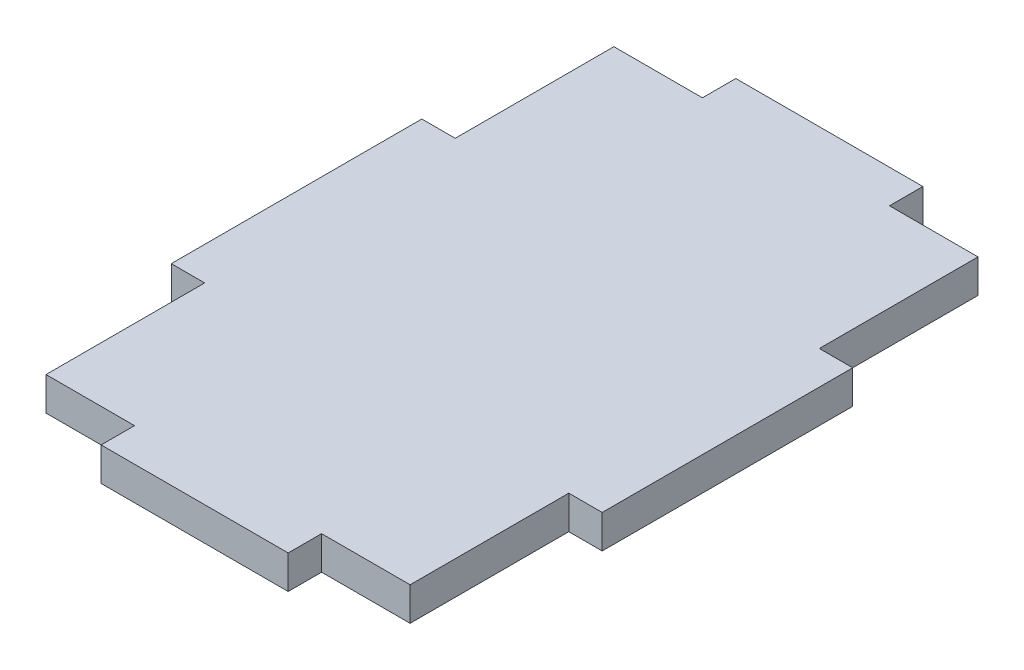
ISO-10303-21;
HEADER;
FILE_DESCRIPTION(('STEP AP214'),'2;1');
FILE_NAME('part.step','',(''),(''),'','','');
FILE_SCHEMA(('AUTOMOTIVE_DESIGN { 1 0 10303 214 1 1 1 1 }'));
ENDSEC;
DATA;
#1=APPLICATION_CONTEXT('core data for automotive mechanical design processes');
#2=APPLICATION_PROTOCOL_DEFINITION('international standard','automotive_design',2000,#1);
#3=PRODUCT_CONTEXT('',#1,'mechanical');
#4=PRODUCT('Part','Part','',(#3));
#5=PRODUCT_RELATED_PRODUCT_CATEGORY('part','',(#4));
#6=PRODUCT_DEFINITION_FORMATION('','',#4);
#7=PRODUCT_DEFINITION_CONTEXT('part definition',#1,'design');
#8=PRODUCT_DEFINITION('design','',#6,#7);
#9=PRODUCT_DEFINITION_SHAPE('','',#8);
#10=(LENGTH_UNIT() NAMED_UNIT(*) SI_UNIT(.MILLI.,.METRE.));
#11=(NAMED_UNIT(*) PLANE_ANGLE_UNIT() SI_UNIT($,.RADIAN.));
#12=(NAMED_UNIT(*) SI_UNIT($,.STERADIAN.) SOLID_ANGLE_UNIT());
#13=UNCERTAINTY_MEASURE_WITH_UNIT(LENGTH_MEASURE(1.E-05),#10,'distance_accuracy_value','');
#14=(GEOMETRIC_REPRESENTATION_CONTEXT(3) GLOBAL_UNCERTAINTY_ASSIGNED_CONTEXT((#13)) GLOBAL_UNIT_ASSIGNED_CONTEXT((#10,
#11,#12)) REPRESENTATION_CONTEXT('',''));
#15=CARTESIAN_POINT('',(0.,0.,0.));
#16=DIRECTION('',(0.,0.,1.));
#17=DIRECTION('',(1.,0.,0.));
#18=AXIS2_PLACEMENT_3D('',#15,#16,#17);
#19=CARTESIAN_POINT('',(32.25,5.,-18.75));
#20=DIRECTION('',(-1.,0.,0.));
#21=DIRECTION('',(0.,0.,1.));
#22=AXIS2_PLACEMENT_3D('',#19,#20,#21);
#23=PLANE('',#22);
#24=DIRECTION('',(0.,0.,-1.));
#25=VECTOR('',#24,1.);
#26=CARTESIAN_POINT('',(32.25,0.,-18.75));
#27=LINE('',#26,#25);
#28=CARTESIAN_POINT('',(32.25,0.,18.75));
#29=VERTEX_POINT('',#28);
#30=CARTESIAN_POINT('',(32.25,0.,-18.75));
#31=VERTEX_POINT('',#30);
#32=EDGE_CURVE('E201',#29,#31,#27,.T.);
#33=ORIENTED_EDGE('',*,*,#32,.T.);
#34=DIRECTION('',(0.,-1.,0.));
#35=VECTOR('',#34,1.);
#36=CARTESIAN_POINT('',(32.25,5.,-18.75));
#37=LINE('',#36,#35);
#38=CARTESIAN_POINT('',(32.25,5.,-18.75));
#39=VERTEX_POINT('',#38);
#40=EDGE_CURVE('E11',#39,#31,#37,.T.);
#41=ORIENTED_EDGE('',*,*,#40,.F.);
#42=DIRECTION('',(0.,0.,-1.));
#43=VECTOR('',#42,1.);
#44=CARTESIAN_POINT('',(32.25,5.,-18.75));
#45=LINE('',#44,#43);
#46=CARTESIAN_POINT('',(32.25,5.,18.75));
#47=VERTEX_POINT('',#46);
#48=EDGE_CURVE('E239',#47,#39,#45,.T.);
#49=ORIENTED_EDGE('',*,*,#48,.F.);
#50=DIRECTION('',(0.,-1.,0.));
#51=VECTOR('',#50,1.);
#52=CARTESIAN_POINT('',(32.25,5.,18.75));
#53=LINE('',#52,#51);
#54=EDGE_CURVE('E197',#47,#29,#53,.T.);
#55=ORIENTED_EDGE('',*,*,#54,.T.);
#56=EDGE_LOOP('',(#33,#41,#49,#55));
#57=FACE_BOUND('',#56,.T.);
#58=ADVANCED_FACE('F33',(#57),#23,.F.);
#59=CARTESIAN_POINT('',(27.25,5.,-18.75));
#60=DIRECTION('',(0.,0.,1.));
#61=DIRECTION('',(1.,0.,0.));
#62=AXIS2_PLACEMENT_3D('',#59,#60,#61);
#63=PLANE('',#62);
#64=DIRECTION('',(-1.,0.,0.));
#65=VECTOR('',#64,1.);
#66=CARTESIAN_POINT('',(27.25,0.,-18.75));
#67=LINE('',#66,#65);
#68=CARTESIAN_POINT('',(27.25,0.,-18.75));
#69=VERTEX_POINT('',#68);
#70=EDGE_CURVE('E204',#31,#69,#67,.T.);
#71=ORIENTED_EDGE('',*,*,#70,.T.);
#72=DIRECTION('',(0.,-1.,0.));
#73=VECTOR('',#72,1.);
#74=CARTESIAN_POINT('',(27.25,5.,-18.75));
#75=LINE('',#74,#73);
#76=CARTESIAN_POINT('',(27.25,5.,-18.75));
#77=VERTEX_POINT('',#76);
#78=EDGE_CURVE('E41',#77,#69,#75,.T.);
#79=ORIENTED_EDGE('',*,*,#78,.F.);
#80=DIRECTION('',(-1.,0.,0.));
#81=VECTOR('',#80,1.);
#82=CARTESIAN_POINT('',(27.25,5.,-18.75));
#83=LINE('',#82,#81);
#84=EDGE_CURVE('E128',#39,#77,#83,.T.);
#85=ORIENTED_EDGE('',*,*,#84,.F.);
#86=ORIENTED_EDGE('',*,*,#40,.T.);
#87=EDGE_LOOP('',(#71,#79,#85,#86));
#88=FACE_BOUND('',#87,.T.);
#89=ADVANCED_FACE('F357',(#88),#63,.F.);
#90=CARTESIAN_POINT('',(27.25,5.,-42.5));
#91=DIRECTION('',(-1.,0.,0.));
#92=DIRECTION('',(0.,0.,1.));
#93=AXIS2_PLACEMENT_3D('',#90,#91,#92);
#94=PLANE('',#93);
#95=DIRECTION('',(0.,0.,-1.));
#96=VECTOR('',#95,1.);
#97=CARTESIAN_POINT('',(27.25,0.,-42.5));
#98=LINE('',#97,#96);
#99=CARTESIAN_POINT('',(27.25,0.,-42.5));
#100=VERTEX_POINT('',#99);
#101=EDGE_CURVE('E206',#69,#100,#98,.T.);
#102=ORIENTED_EDGE('',*,*,#101,.T.);
#103=DIRECTION('',(0.,-1.,0.));
#104=VECTOR('',#103,1.);
#105=CARTESIAN_POINT('',(27.25,5.,-42.5));
#106=LINE('',#105,#104);
#107=CARTESIAN_POINT('',(27.25,5.,-42.5));
#108=VERTEX_POINT('',#107);
#109=EDGE_CURVE('E282',#108,#100,#106,.T.);
#110=ORIENTED_EDGE('',*,*,#109,.F.);
#111=DIRECTION('',(0.,0.,-1.));
#112=VECTOR('',#111,1.);
#113=CARTESIAN_POINT('',(27.25,5.,-42.5));
#114=LINE('',#113,#112);
#115=EDGE_CURVE('E290',#77,#108,#114,.T.);
#116=ORIENTED_EDGE('',*,*,#115,.F.);
#117=ORIENTED_EDGE('',*,*,#78,.T.);
#118=EDGE_LOOP('',(#102,#110,#116,#117));
#119=FACE_BOUND('',#118,.T.);
#120=ADVANCED_FACE('F288',(#119),#94,.F.);
#121=CARTESIAN_POINT('',(14.,5.,-42.5));
#122=DIRECTION('',(0.,0.,1.));
#123=DIRECTION('',(1.,0.,0.));
#124=AXIS2_PLACEMENT_3D('',#121,#122,#123);
#125=PLANE('',#124);
#126=DIRECTION('',(-1.,0.,0.));
#127=VECTOR('',#126,1.);
#128=CARTESIAN_POINT('',(14.,0.,-42.5));
#129=LINE('',#128,#127);
#130=CARTESIAN_POINT('',(14.,0.,-42.5));
#131=VERTEX_POINT('',#130);
#132=EDGE_CURVE('E208',#100,#131,#129,.T.);
#133=ORIENTED_EDGE('',*,*,#132,.T.);
#134=DIRECTION('',(0.,-1.,0.));
#135=VECTOR('',#134,1.);
#136=CARTESIAN_POINT('',(14.,5.,-42.5));
#137=LINE('',#136,#135);
#138=CARTESIAN_POINT('',(14.,5.,-42.5));
#139=VERTEX_POINT('',#138);
#140=EDGE_CURVE('E279',#139,#131,#137,.T.);
#141=ORIENTED_EDGE('',*,*,#140,.F.);
#142=DIRECTION('',(-1.,0.,0.));
#143=VECTOR('',#142,1.);
#144=CARTESIAN_POINT('',(14.,5.,-42.5));
#145=LINE('',#144,#143);
#146=EDGE_CURVE('E308',#108,#139,#145,.T.);
#147=ORIENTED_EDGE('',*,*,#146,.F.);
#148=ORIENTED_EDGE('',*,*,#109,.T.);
#149=EDGE_LOOP('',(#133,#141,#147,#148));
#150=FACE_BOUND('',#149,.T.);
#151=ADVANCED_FACE('F299',(#150),#125,.F.);
#152=CARTESIAN_POINT('',(14.,5.,-47.5));
#153=DIRECTION('',(-1.,0.,0.));
#154=DIRECTION('',(0.,0.,1.));
#155=AXIS2_PLACEMENT_3D('',#152,#153,#154);
#156=PLANE('',#155);
#157=DIRECTION('',(0.,0.,-1.));
#158=VECTOR('',#157,1.);
#159=CARTESIAN_POINT('',(14.,0.,-47.5));
#160=LINE('',#159,#158);
#161=CARTESIAN_POINT('',(14.,0.,-47.5));
#162=VERTEX_POINT('',#161);
#163=EDGE_CURVE('E210',#131,#162,#160,.T.);
#164=ORIENTED_EDGE('',*,*,#163,.T.);
#165=DIRECTION('',(0.,-1.,0.));
#166=VECTOR('',#165,1.);
#167=CARTESIAN_POINT('',(14.,5.,-47.5));
#168=LINE('',#167,#166);
#169=CARTESIAN_POINT('',(14.,5.,-47.5));
#170=VERTEX_POINT('',#169);
#171=EDGE_CURVE('E276',#170,#162,#168,.T.);
#172=ORIENTED_EDGE('',*,*,#171,.F.);
#173=DIRECTION('',(0.,0.,-1.));
#174=VECTOR('',#173,1.);
#175=CARTESIAN_POINT('',(14.,5.,-47.5));
#176=LINE('',#175,#174);
#177=EDGE_CURVE('E305',#139,#170,#176,.T.);
#178=ORIENTED_EDGE('',*,*,#177,.F.);
#179=ORIENTED_EDGE('',*,*,#140,.T.);
#180=EDGE_LOOP('',(#164,#172,#178,#179));
#181=FACE_BOUND('',#180,.T.);
#182=ADVANCED_FACE('F303',(#181),#156,.F.);
#183=CARTESIAN_POINT('',(-14.,5.,-47.5));
#184=DIRECTION('',(0.,0.,1.));
#185=DIRECTION('',(1.,0.,0.));
#186=AXIS2_PLACEMENT_3D('',#183,#184,#185);
#187=PLANE('',#186);
#188=DIRECTION('',(-1.,0.,0.));
#189=VECTOR('',#188,1.);
#190=CARTESIAN_POINT('',(-14.,0.,-47.5));
#191=LINE('',#190,#189);
#192=CARTESIAN_POINT('',(-14.,0.,-47.5));
#193=VERTEX_POINT('',#192);
#194=EDGE_CURVE('E212',#162,#193,#191,.T.);
#195=ORIENTED_EDGE('',*,*,#194,.T.);
#196=DIRECTION('',(0.,-1.,0.));
#197=VECTOR('',#196,1.);
#198=CARTESIAN_POINT('',(-14.,5.,-47.5));
#199=LINE('',#198,#197);
#200=CARTESIAN_POINT('',(-14.,5.,-47.5));
#201=VERTEX_POINT('',#200);
#202=EDGE_CURVE('E273',#201,#193,#199,.T.);
#203=ORIENTED_EDGE('',*,*,#202,.F.);
#204=DIRECTION('',(-1.,0.,0.));
#205=VECTOR('',#204,1.);
#206=CARTESIAN_POINT('',(-14.,5.,-47.5));
#207=LINE('',#206,#205);
#208=EDGE_CURVE('E307',#170,#201,#207,.T.);
#209=ORIENTED_EDGE('',*,*,#208,.F.);
#210=ORIENTED_EDGE('',*,*,#171,.T.);
#211=EDGE_LOOP('',(#195,#203,#209,#210));
#212=FACE_BOUND('',#211,.T.);
#213=ADVANCED_FACE('F370',(#212),#187,.F.);
#214=CARTESIAN_POINT('',(-14.,5.,-42.5));
#215=DIRECTION('',(1.,0.,0.));
#216=DIRECTION('',(0.,0.,-1.));
#217=AXIS2_PLACEMENT_3D('',#214,#215,#216);
#218=PLANE('',#217);
#219=DIRECTION('',(0.,0.,1.));
#220=VECTOR('',#219,1.);
#221=CARTESIAN_POINT('',(-14.,0.,-42.5));
#222=LINE('',#221,#220);
#223=CARTESIAN_POINT('',(-14.,0.,-42.5));
#224=VERTEX_POINT('',#223);
#225=EDGE_CURVE('E214',#193,#224,#222,.T.);
#226=ORIENTED_EDGE('',*,*,#225,.T.);
#227=DIRECTION('',(0.,-1.,0.));
#228=VECTOR('',#227,1.);
#229=CARTESIAN_POINT('',(-14.,5.,-42.5));
#230=LINE('',#229,#228);
#231=CARTESIAN_POINT('',(-14.,5.,-42.5));
#232=VERTEX_POINT('',#231);
#233=EDGE_CURVE('E270',#232,#224,#230,.T.);
#234=ORIENTED_EDGE('',*,*,#233,.F.);
#235=DIRECTION('',(0.,0.,1.));
#236=VECTOR('',#235,1.);
#237=CARTESIAN_POINT('',(-14.,5.,-42.5));
#238=LINE('',#237,#236);
#239=EDGE_CURVE('E310',#201,#232,#238,.T.);
#240=ORIENTED_EDGE('',*,*,#239,.F.);
#241=ORIENTED_EDGE('',*,*,#202,.T.);
#242=EDGE_LOOP('',(#226,#234,#240,#241));
#243=FACE_BOUND('',#242,.T.);
#244=ADVANCED_FACE('F373',(#243),#218,.F.);
#245=CARTESIAN_POINT('',(-27.25,5.,-42.5));
#246=DIRECTION('',(0.,0.,1.));
#247=DIRECTION('',(1.,0.,0.));
#248=AXIS2_PLACEMENT_3D('',#245,#246,#247);
#249=PLANE('',#248);
#250=DIRECTION('',(-1.,0.,0.));
#251=VECTOR('',#250,1.);
#252=CARTESIAN_POINT('',(-27.25,0.,-42.5));
#253=LINE('',#252,#251);
#254=CARTESIAN_POINT('',(-27.25,0.,-42.5));
#255=VERTEX_POINT('',#254);
#256=EDGE_CURVE('E216',#224,#255,#253,.T.);
#257=ORIENTED_EDGE('',*,*,#256,.T.);
#258=DIRECTION('',(0.,-1.,0.));
#259=VECTOR('',#258,1.);
#260=CARTESIAN_POINT('',(-27.25,5.,-42.5));
#261=LINE('',#260,#259);
#262=CARTESIAN_POINT('',(-27.25,5.,-42.5));
#263=VERTEX_POINT('',#262);
#264=EDGE_CURVE('E267',#263,#255,#261,.T.);
#265=ORIENTED_EDGE('',*,*,#264,.F.);
#266=DIRECTION('',(-1.,0.,0.));
#267=VECTOR('',#266,1.);
#268=CARTESIAN_POINT('',(-27.25,5.,-42.5));
#269=LINE('',#268,#267);
#270=EDGE_CURVE('E316',#232,#263,#269,.T.);
#271=ORIENTED_EDGE('',*,*,#270,.F.);
#272=ORIENTED_EDGE('',*,*,#233,.T.);
#273=EDGE_LOOP('',(#257,#265,#271,#272));
#274=FACE_BOUND('',#273,.T.);
#275=ADVANCED_FACE('F377',(#274),#249,.F.);
#276=CARTESIAN_POINT('',(-27.25,5.,-42.5));
#277=DIRECTION('',(1.,0.,0.));
#278=DIRECTION('',(0.,0.,-1.));
#279=AXIS2_PLACEMENT_3D('',#276,#277,#278);
#280=PLANE('',#279);
#281=DIRECTION('',(0.,0.,1.));
#282=VECTOR('',#281,1.);
#283=CARTESIAN_POINT('',(-27.25,0.,-42.5));
#284=LINE('',#283,#282);
#285=CARTESIAN_POINT('',(-27.25,0.,-18.75));
#286=VERTEX_POINT('',#285);
#287=EDGE_CURVE('E218',#255,#286,#284,.T.);
#288=ORIENTED_EDGE('',*,*,#287,.T.);
#289=DIRECTION('',(0.,-1.,0.));
#290=VECTOR('',#289,1.);
#291=CARTESIAN_POINT('',(-27.25,5.,-18.75));
#292=LINE('',#291,#290);
#293=CARTESIAN_POINT('',(-27.25,5.,-18.75));
#294=VERTEX_POINT('',#293);
#295=EDGE_CURVE('E264',#294,#286,#292,.T.);
#296=ORIENTED_EDGE('',*,*,#295,.F.);
#297=DIRECTION('',(0.,0.,1.));
#298=VECTOR('',#297,1.);
#299=CARTESIAN_POINT('',(-27.25,5.,-42.5));
#300=LINE('',#299,#298);
#301=EDGE_CURVE('E318',#263,#294,#300,.T.);
#302=ORIENTED_EDGE('',*,*,#301,.F.);
#303=ORIENTED_EDGE('',*,*,#264,.T.);
#304=EDGE_LOOP('',(#288,#296,#302,#303));
#305=FACE_BOUND('',#304,.T.);
#306=ADVANCED_FACE('F381',(#305),#280,.F.);
#307=CARTESIAN_POINT('',(-27.25,5.,-18.75));
#308=DIRECTION('',(0.,0.,1.));
#309=DIRECTION('',(1.,0.,0.));
#310=AXIS2_PLACEMENT_3D('',#307,#308,#309);
#311=PLANE('',#310);
#312=DIRECTION('',(-1.,0.,0.));
#313=VECTOR('',#312,1.);
#314=CARTESIAN_POINT('',(-27.25,0.,-18.75));
#315=LINE('',#314,#313);
#316=CARTESIAN_POINT('',(-32.25,0.,-18.75));
#317=VERTEX_POINT('',#316);
#318=EDGE_CURVE('E220',#286,#317,#315,.T.);
#319=ORIENTED_EDGE('',*,*,#318,.T.);
#320=DIRECTION('',(0.,-1.,0.));
#321=VECTOR('',#320,1.);
#322=CARTESIAN_POINT('',(-32.25,5.,-18.75));
#323=LINE('',#322,#321);
#324=CARTESIAN_POINT('',(-32.25,5.,-18.75));
#325=VERTEX_POINT('',#324);
#326=EDGE_CURVE('E261',#325,#317,#323,.T.);
#327=ORIENTED_EDGE('',*,*,#326,.F.);
#328=DIRECTION('',(-1.,0.,0.));
#329=VECTOR('',#328,1.);
#330=CARTESIAN_POINT('',(-27.25,5.,-18.75));
#331=LINE('',#330,#329);
#332=EDGE_CURVE('E320',#294,#325,#331,.T.);
#333=ORIENTED_EDGE('',*,*,#332,.F.);
#334=ORIENTED_EDGE('',*,*,#295,.T.);
#335=EDGE_LOOP('',(#319,#327,#333,#334));
#336=FACE_BOUND('',#335,.T.);
#337=ADVANCED_FACE('F385',(#336),#311,.F.);
#338=CARTESIAN_POINT('',(-32.25,5.,-18.75));
#339=DIRECTION('',(1.,0.,0.));
#340=DIRECTION('',(0.,0.,-1.));
#341=AXIS2_PLACEMENT_3D('',#338,#339,#340);
#342=PLANE('',#341);
#343=DIRECTION('',(0.,0.,1.));
#344=VECTOR('',#343,1.);
#345=CARTESIAN_POINT('',(-32.25,0.,-18.75));
#346=LINE('',#345,#344);
#347=CARTESIAN_POINT('',(-32.25,0.,18.75));
#348=VERTEX_POINT('',#347);
#349=EDGE_CURVE('E222',#317,#348,#346,.T.);
#350=ORIENTED_EDGE('',*,*,#349,.T.);
#351=DIRECTION('',(0.,-1.,0.));
#352=VECTOR('',#351,1.);
#353=CARTESIAN_POINT('',(-32.25,5.,18.75));
#354=LINE('',#353,#352);
#355=CARTESIAN_POINT('',(-32.25,5.,18.75));
#356=VERTEX_POINT('',#355);
#357=EDGE_CURVE('E258',#356,#348,#354,.T.);
#358=ORIENTED_EDGE('',*,*,#357,.F.);
#359=DIRECTION('',(0.,0.,1.));
#360=VECTOR('',#359,1.);
#361=CARTESIAN_POINT('',(-32.25,5.,-18.75));
#362=LINE('',#361,#360);
#363=EDGE_CURVE('E322',#325,#356,#362,.T.);
#364=ORIENTED_EDGE('',*,*,#363,.F.);
#365=ORIENTED_EDGE('',*,*,#326,.T.);
#366=EDGE_LOOP('',(#350,#358,#364,#365));
#367=FACE_BOUND('',#366,.T.);
#368=ADVANCED_FACE('F389',(#367),#342,.F.);
#369=CARTESIAN_POINT('',(-32.25,5.,18.75));
#370=DIRECTION('',(0.,0.,-1.));
#371=DIRECTION('',(-1.,0.,0.));
#372=AXIS2_PLACEMENT_3D('',#369,#370,#371);
#373=PLANE('',#372);
#374=DIRECTION('',(1.,0.,0.));
#375=VECTOR('',#374,1.);
#376=CARTESIAN_POINT('',(-32.25,0.,18.75));
#377=LINE('',#376,#375);
#378=CARTESIAN_POINT('',(-27.25,0.,18.75));
#379=VERTEX_POINT('',#378);
#380=EDGE_CURVE('E224',#348,#379,#377,.T.);
#381=ORIENTED_EDGE('',*,*,#380,.T.);
#382=DIRECTION('',(0.,-1.,0.));
#383=VECTOR('',#382,1.);
#384=CARTESIAN_POINT('',(-27.25,5.,18.75));
#385=LINE('',#384,#383);
#386=CARTESIAN_POINT('',(-27.25,5.,18.75));
#387=VERTEX_POINT('',#386);
#388=EDGE_CURVE('E255',#387,#379,#385,.T.);
#389=ORIENTED_EDGE('',*,*,#388,.F.);
#390=DIRECTION('',(1.,0.,0.));
#391=VECTOR('',#390,1.);
#392=CARTESIAN_POINT('',(-32.25,5.,18.75));
#393=LINE('',#392,#391);
#394=EDGE_CURVE('E324',#356,#387,#393,.T.);
#395=ORIENTED_EDGE('',*,*,#394,.F.);
#396=ORIENTED_EDGE('',*,*,#357,.T.);
#397=EDGE_LOOP('',(#381,#389,#395,#396));
#398=FACE_BOUND('',#397,.T.);
#399=ADVANCED_FACE('F393',(#398),#373,.F.);
#400=CARTESIAN_POINT('',(-27.25,5.,18.75));
#401=DIRECTION('',(1.,0.,0.));
#402=DIRECTION('',(0.,0.,-1.));
#403=AXIS2_PLACEMENT_3D('',#400,#401,#402);
#404=PLANE('',#403);
#405=DIRECTION('',(0.,0.,1.));
#406=VECTOR('',#405,1.);
#407=CARTESIAN_POINT('',(-27.25,0.,18.75));
#408=LINE('',#407,#406);
#409=CARTESIAN_POINT('',(-27.25,0.,42.5));
#410=VERTEX_POINT('',#409);
#411=EDGE_CURVE('E226',#379,#410,#408,.T.);
#412=ORIENTED_EDGE('',*,*,#411,.T.);
#413=DIRECTION('',(0.,-1.,0.));
#414=VECTOR('',#413,1.);
#415=CARTESIAN_POINT('',(-27.25,5.,42.5));
#416=LINE('',#415,#414);
#417=CARTESIAN_POINT('',(-27.25,5.,42.5));
#418=VERTEX_POINT('',#417);
#419=EDGE_CURVE('E252',#418,#410,#416,.T.);
#420=ORIENTED_EDGE('',*,*,#419,.F.);
#421=DIRECTION('',(0.,0.,1.));
#422=VECTOR('',#421,1.);
#423=CARTESIAN_POINT('',(-27.25,5.,18.75));
#424=LINE('',#423,#422);
#425=EDGE_CURVE('E326',#387,#418,#424,.T.);
#426=ORIENTED_EDGE('',*,*,#425,.F.);
#427=ORIENTED_EDGE('',*,*,#388,.T.);
#428=EDGE_LOOP('',(#412,#420,#426,#427));
#429=FACE_BOUND('',#428,.T.);
#430=ADVANCED_FACE('F397',(#429),#404,.F.);
#431=CARTESIAN_POINT('',(-27.25,5.,42.5));
#432=DIRECTION('',(0.,0.,-1.));
#433=DIRECTION('',(-1.,0.,0.));
#434=AXIS2_PLACEMENT_3D('',#431,#432,#433);
#435=PLANE('',#434);
#436=DIRECTION('',(1.,0.,0.));
#437=VECTOR('',#436,1.);
#438=CARTESIAN_POINT('',(-27.25,0.,42.5));
#439=LINE('',#438,#437);
#440=CARTESIAN_POINT('',(-14.,0.,42.5));
#441=VERTEX_POINT('',#440);
#442=EDGE_CURVE('E228',#410,#441,#439,.T.);
#443=ORIENTED_EDGE('',*,*,#442,.T.);
#444=DIRECTION('',(0.,-1.,0.));
#445=VECTOR('',#444,1.);
#446=CARTESIAN_POINT('',(-14.,5.,42.5));
#447=LINE('',#446,#445);
#448=CARTESIAN_POINT('',(-14.,5.,42.5));
#449=VERTEX_POINT('',#448);
#450=EDGE_CURVE('E249',#449,#441,#447,.T.);
#451=ORIENTED_EDGE('',*,*,#450,.F.);
#452=DIRECTION('',(1.,0.,0.));
#453=VECTOR('',#452,1.);
#454=CARTESIAN_POINT('',(-27.25,5.,42.5));
#455=LINE('',#454,#453);
#456=EDGE_CURVE('E328',#418,#449,#455,.T.);
#457=ORIENTED_EDGE('',*,*,#456,.F.);
#458=ORIENTED_EDGE('',*,*,#419,.T.);
#459=EDGE_LOOP('',(#443,#451,#457,#458));
#460=FACE_BOUND('',#459,.T.);
#461=ADVANCED_FACE('F401',(#460),#435,.F.);
#462=CARTESIAN_POINT('',(-14.,5.,42.5));
#463=DIRECTION('',(1.,0.,0.));
#464=DIRECTION('',(0.,0.,-1.));
#465=AXIS2_PLACEMENT_3D('',#462,#463,#464);
#466=PLANE('',#465);
#467=DIRECTION('',(0.,0.,1.));
#468=VECTOR('',#467,1.);
#469=CARTESIAN_POINT('',(-14.,0.,42.5));
#470=LINE('',#469,#468);
#471=CARTESIAN_POINT('',(-14.,0.,47.5));
#472=VERTEX_POINT('',#471);
#473=EDGE_CURVE('E230',#441,#472,#470,.T.);
#474=ORIENTED_EDGE('',*,*,#473,.T.);
#475=DIRECTION('',(0.,-1.,0.));
#476=VECTOR('',#475,1.);
#477=CARTESIAN_POINT('',(-14.,5.,47.5));
#478=LINE('',#477,#476);
#479=CARTESIAN_POINT('',(-14.,5.,47.5));
#480=VERTEX_POINT('',#479);
#481=EDGE_CURVE('E246',#480,#472,#478,.T.);
#482=ORIENTED_EDGE('',*,*,#481,.F.);
#483=DIRECTION('',(0.,0.,1.));
#484=VECTOR('',#483,1.);
#485=CARTESIAN_POINT('',(-14.,5.,42.5));
#486=LINE('',#485,#484);
#487=EDGE_CURVE('E330',#449,#480,#486,.T.);
#488=ORIENTED_EDGE('',*,*,#487,.F.);
#489=ORIENTED_EDGE('',*,*,#450,.T.);
#490=EDGE_LOOP('',(#474,#482,#488,#489));
#491=FACE_BOUND('',#490,.T.);
#492=ADVANCED_FACE('F405',(#491),#466,.F.);
#493=CARTESIAN_POINT('',(-14.,5.,47.5));
#494=DIRECTION('',(0.,0.,-1.));
#495=DIRECTION('',(-1.,0.,0.));
#496=AXIS2_PLACEMENT_3D('',#493,#494,#495);
#497=PLANE('',#496);
#498=DIRECTION('',(1.,0.,0.));
#499=VECTOR('',#498,1.);
#500=CARTESIAN_POINT('',(-14.,0.,47.5));
#501=LINE('',#500,#499);
#502=CARTESIAN_POINT('',(14.,0.,47.5));
#503=VERTEX_POINT('',#502);
#504=EDGE_CURVE('E232',#472,#503,#501,.T.);
#505=ORIENTED_EDGE('',*,*,#504,.T.);
#506=DIRECTION('',(0.,-1.,0.));
#507=VECTOR('',#506,1.);
#508=CARTESIAN_POINT('',(14.,5.,47.5));
#509=LINE('',#508,#507);
#510=CARTESIAN_POINT('',(14.,5.,47.5));
#511=VERTEX_POINT('',#510);
#512=EDGE_CURVE('E243',#511,#503,#509,.T.);
#513=ORIENTED_EDGE('',*,*,#512,.F.);
#514=DIRECTION('',(1.,0.,0.));
#515=VECTOR('',#514,1.);
#516=CARTESIAN_POINT('',(-14.,5.,47.5));
#517=LINE('',#516,#515);
#518=EDGE_CURVE('E332',#480,#511,#517,.T.);
#519=ORIENTED_EDGE('',*,*,#518,.F.);
#520=ORIENTED_EDGE('',*,*,#481,.T.);
#521=EDGE_LOOP('',(#505,#513,#519,#520));
#522=FACE_BOUND('',#521,.T.);
#523=ADVANCED_FACE('F338',(#522),#497,.F.);
#524=CARTESIAN_POINT('',(14.,5.,47.5));
#525=DIRECTION('',(-1.,0.,0.));
#526=DIRECTION('',(0.,0.,1.));
#527=AXIS2_PLACEMENT_3D('',#524,#525,#526);
#528=PLANE('',#527);
#529=DIRECTION('',(0.,0.,-1.));
#530=VECTOR('',#529,1.);
#531=CARTESIAN_POINT('',(14.,0.,47.5));
#532=LINE('',#531,#530);
#533=CARTESIAN_POINT('',(14.,0.,42.5));
#534=VERTEX_POINT('',#533);
#535=EDGE_CURVE('E234',#503,#534,#532,.T.);
#536=ORIENTED_EDGE('',*,*,#535,.T.);
#537=DIRECTION('',(0.,-1.,0.));
#538=VECTOR('',#537,1.);
#539=CARTESIAN_POINT('',(14.,5.,42.5));
#540=LINE('',#539,#538);
#541=CARTESIAN_POINT('',(14.,5.,42.5));
#542=VERTEX_POINT('',#541);
#543=EDGE_CURVE('E192',#542,#534,#540,.T.);
#544=ORIENTED_EDGE('',*,*,#543,.F.);
#545=DIRECTION('',(0.,0.,-1.));
#546=VECTOR('',#545,1.);
#547=CARTESIAN_POINT('',(14.,5.,47.5));
#548=LINE('',#547,#546);
#549=EDGE_CURVE('E183',#511,#542,#548,.T.);
#550=ORIENTED_EDGE('',*,*,#549,.F.);
#551=ORIENTED_EDGE('',*,*,#512,.T.);
#552=EDGE_LOOP('',(#536,#544,#550,#551));
#553=FACE_BOUND('',#552,.T.);
#554=ADVANCED_FACE('F342',(#553),#528,.F.);
#555=CARTESIAN_POINT('',(14.,5.,42.5));
#556=DIRECTION('',(0.,0.,-1.));
#557=DIRECTION('',(-1.,0.,0.));
#558=AXIS2_PLACEMENT_3D('',#555,#556,#557);
#559=PLANE('',#558);
#560=DIRECTION('',(1.,0.,0.));
#561=VECTOR('',#560,1.);
#562=CARTESIAN_POINT('',(14.,0.,42.5));
#563=LINE('',#562,#561);
#564=CARTESIAN_POINT('',(27.25,0.,42.5));
#565=VERTEX_POINT('',#564);
#566=EDGE_CURVE('E191',#534,#565,#563,.T.);
#567=ORIENTED_EDGE('',*,*,#566,.T.);
#568=DIRECTION('',(0.,-1.,0.));
#569=VECTOR('',#568,1.);
#570=CARTESIAN_POINT('',(27.25,5.,42.5));
#571=LINE('',#570,#569);
#572=CARTESIAN_POINT('',(27.25,5.,42.5));
#573=VERTEX_POINT('',#572);
#574=EDGE_CURVE('E188',#573,#565,#571,.T.);
#575=ORIENTED_EDGE('',*,*,#574,.F.);
#576=DIRECTION('',(1.,0.,0.));
#577=VECTOR('',#576,1.);
#578=CARTESIAN_POINT('',(14.,5.,42.5));
#579=LINE('',#578,#577);
#580=EDGE_CURVE('E177',#542,#573,#579,.T.);
#581=ORIENTED_EDGE('',*,*,#580,.F.);
#582=ORIENTED_EDGE('',*,*,#543,.T.);
#583=EDGE_LOOP('',(#567,#575,#581,#582));
#584=FACE_BOUND('',#583,.T.);
#585=ADVANCED_FACE('F189',(#584),#559,.F.);
#586=CARTESIAN_POINT('',(27.25,5.,18.75));
#587=DIRECTION('',(-1.,0.,0.));
#588=DIRECTION('',(0.,0.,1.));
#589=AXIS2_PLACEMENT_3D('',#586,#587,#588);
#590=PLANE('',#589);
#591=DIRECTION('',(0.,0.,-1.));
#592=VECTOR('',#591,1.);
#593=CARTESIAN_POINT('',(27.25,0.,18.75));
#594=LINE('',#593,#592);
#595=CARTESIAN_POINT('',(27.25,0.,18.75));
#596=VERTEX_POINT('',#595);
#597=EDGE_CURVE('E114',#565,#596,#594,.T.);
#598=ORIENTED_EDGE('',*,*,#597,.T.);
#599=DIRECTION('',(0.,-1.,0.));
#600=VECTOR('',#599,1.);
#601=CARTESIAN_POINT('',(27.25,5.,18.75));
#602=LINE('',#601,#600);
#603=CARTESIAN_POINT('',(27.25,5.,18.75));
#604=VERTEX_POINT('',#603);
#605=EDGE_CURVE('E193',#604,#596,#602,.T.);
#606=ORIENTED_EDGE('',*,*,#605,.F.);
#607=DIRECTION('',(0.,0.,-1.));
#608=VECTOR('',#607,1.);
#609=CARTESIAN_POINT('',(27.25,5.,18.75));
#610=LINE('',#609,#608);
#611=EDGE_CURVE('E181',#573,#604,#610,.T.);
#612=ORIENTED_EDGE('',*,*,#611,.F.);
#613=ORIENTED_EDGE('',*,*,#574,.T.);
#614=EDGE_LOOP('',(#598,#606,#612,#613));
#615=FACE_BOUND('',#614,.T.);
#616=ADVANCED_FACE('F195',(#615),#590,.F.);
#617=CARTESIAN_POINT('',(32.25,5.,18.75));
#618=DIRECTION('',(0.,0.,-1.));
#619=DIRECTION('',(-1.,0.,0.));
#620=AXIS2_PLACEMENT_3D('',#617,#618,#619);
#621=PLANE('',#620);
#622=DIRECTION('',(1.,0.,0.));
#623=VECTOR('',#622,1.);
#624=CARTESIAN_POINT('',(32.25,0.,18.75));
#625=LINE('',#624,#623);
#626=EDGE_CURVE('E120',#596,#29,#625,.T.);
#627=ORIENTED_EDGE('',*,*,#626,.T.);
#628=ORIENTED_EDGE('',*,*,#54,.F.);
#629=DIRECTION('',(1.,0.,0.));
#630=VECTOR('',#629,1.);
#631=CARTESIAN_POINT('',(32.25,5.,18.75));
#632=LINE('',#631,#630);
#633=EDGE_CURVE('E49',#604,#47,#632,.T.);
#634=ORIENTED_EDGE('',*,*,#633,.F.);
#635=ORIENTED_EDGE('',*,*,#605,.T.);
#636=EDGE_LOOP('',(#627,#628,#634,#635));
#637=FACE_BOUND('',#636,.T.);
#638=ADVANCED_FACE('F346',(#637),#621,.F.);
#639=CARTESIAN_POINT('',(0.,5.,0.));
#640=DIRECTION('',(0.,-1.,0.));
#641=DIRECTION('',(0.,0.,-1.));
#642=AXIS2_PLACEMENT_3D('',#639,#640,#641);
#643=PLANE('',#642);
#644=ORIENTED_EDGE('',*,*,#48,.T.);
#645=ORIENTED_EDGE('',*,*,#84,.T.);
#646=ORIENTED_EDGE('',*,*,#115,.T.);
#647=ORIENTED_EDGE('',*,*,#146,.T.);
#648=ORIENTED_EDGE('',*,*,#177,.T.);
#649=ORIENTED_EDGE('',*,*,#208,.T.);
#650=ORIENTED_EDGE('',*,*,#239,.T.);
#651=ORIENTED_EDGE('',*,*,#270,.T.);
#652=ORIENTED_EDGE('',*,*,#301,.T.);
#653=ORIENTED_EDGE('',*,*,#332,.T.);
#654=ORIENTED_EDGE('',*,*,#363,.T.);
#655=ORIENTED_EDGE('',*,*,#394,.T.);
#656=ORIENTED_EDGE('',*,*,#425,.T.);
#657=ORIENTED_EDGE('',*,*,#456,.T.);
#658=ORIENTED_EDGE('',*,*,#487,.T.);
#659=ORIENTED_EDGE('',*,*,#518,.T.);
#660=ORIENTED_EDGE('',*,*,#549,.T.);
#661=ORIENTED_EDGE('',*,*,#580,.T.);
#662=ORIENTED_EDGE('',*,*,#611,.T.);
#663=ORIENTED_EDGE('',*,*,#633,.T.);
#664=EDGE_LOOP('',(#644,#645,#646,#647,#648,#649,#650,#651,#652,#653,#654,#655,#656,#657,#658,
#659,#660,#661,#662,#663));
#665=FACE_BOUND('',#664,.T.);
#666=ADVANCED_FACE('F179',(#665),#643,.F.);
#667=CARTESIAN_POINT('',(0.,0.,0.));
#668=DIRECTION('',(0.,-1.,0.));
#669=DIRECTION('',(0.,0.,-1.));
#670=AXIS2_PLACEMENT_3D('',#667,#668,#669);
#671=PLANE('',#670);
#672=ORIENTED_EDGE('',*,*,#32,.F.);
#673=ORIENTED_EDGE('',*,*,#626,.F.);
#674=ORIENTED_EDGE('',*,*,#597,.F.);
#675=ORIENTED_EDGE('',*,*,#566,.F.);
#676=ORIENTED_EDGE('',*,*,#535,.F.);
#677=ORIENTED_EDGE('',*,*,#504,.F.);
#678=ORIENTED_EDGE('',*,*,#473,.F.);
#679=ORIENTED_EDGE('',*,*,#442,.F.);
#680=ORIENTED_EDGE('',*,*,#411,.F.);
#681=ORIENTED_EDGE('',*,*,#380,.F.);
#682=ORIENTED_EDGE('',*,*,#349,.F.);
#683=ORIENTED_EDGE('',*,*,#318,.F.);
#684=ORIENTED_EDGE('',*,*,#287,.F.);
#685=ORIENTED_EDGE('',*,*,#256,.F.);
#686=ORIENTED_EDGE('',*,*,#225,.F.);
#687=ORIENTED_EDGE('',*,*,#194,.F.);
#688=ORIENTED_EDGE('',*,*,#163,.F.);
#689=ORIENTED_EDGE('',*,*,#132,.F.);
#690=ORIENTED_EDGE('',*,*,#101,.F.);
#691=ORIENTED_EDGE('',*,*,#70,.F.);
#692=EDGE_LOOP('',(#672,#673,#674,#675,#676,#677,#678,#679,#680,#681,#682,#683,#684,#685,#686,
#687,#688,#689,#690,#691));
#693=FACE_BOUND('',#692,.T.);
#694=ADVANCED_FACE('F294',(#693),#671,.T.);
#695=CLOSED_SHELL('',(#58,#89,#120,#151,#182,#213,#244,#275,#306,#337,#368,#399,#430,#461,#492,
#523,#554,#585,#616,#638,#666,#694));
#696=MANIFOLD_SOLID_BREP('B2',#695);
#697=ADVANCED_BREP_SHAPE_REPRESENTATION('',(#18,#696),#14);
#698=SHAPE_DEFINITION_REPRESENTATION(#9,#697);
ENDSEC;
END-ISO-10303-21;
